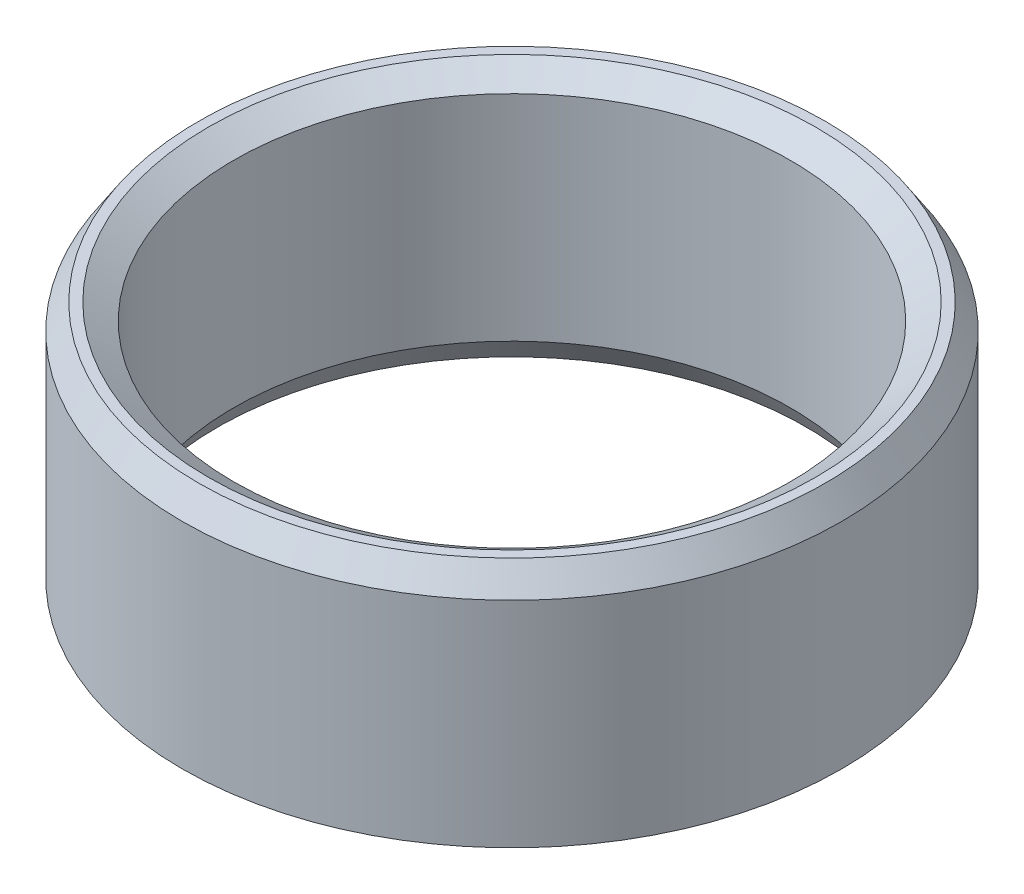
ISO-10303-21;
HEADER;
FILE_DESCRIPTION(('STEP AP214'),'2;1');
FILE_NAME('part.step','',(''),(''),'','','');
FILE_SCHEMA(('AUTOMOTIVE_DESIGN { 1 0 10303 214 1 1 1 1 }'));
ENDSEC;
DATA;
#1=APPLICATION_CONTEXT('core data for automotive mechanical design processes');
#2=APPLICATION_PROTOCOL_DEFINITION('international standard','automotive_design',2000,#1);
#3=PRODUCT_CONTEXT('',#1,'mechanical');
#4=PRODUCT('Part','Part','',(#3));
#5=PRODUCT_RELATED_PRODUCT_CATEGORY('part','',(#4));
#6=PRODUCT_DEFINITION_FORMATION('','',#4);
#7=PRODUCT_DEFINITION_CONTEXT('part definition',#1,'design');
#8=PRODUCT_DEFINITION('design','',#6,#7);
#9=PRODUCT_DEFINITION_SHAPE('','',#8);
#10=(LENGTH_UNIT() NAMED_UNIT(*) SI_UNIT(.MILLI.,.METRE.));
#11=(NAMED_UNIT(*) PLANE_ANGLE_UNIT() SI_UNIT($,.RADIAN.));
#12=(NAMED_UNIT(*) SI_UNIT($,.STERADIAN.) SOLID_ANGLE_UNIT());
#13=UNCERTAINTY_MEASURE_WITH_UNIT(LENGTH_MEASURE(1.E-05),#10,'distance_accuracy_value','');
#14=(GEOMETRIC_REPRESENTATION_CONTEXT(3) GLOBAL_UNCERTAINTY_ASSIGNED_CONTEXT((#13)) GLOBAL_UNIT_ASSIGNED_CONTEXT((#10,
#11,#12)) REPRESENTATION_CONTEXT('',''));
#15=CARTESIAN_POINT('',(0.,0.,0.));
#16=DIRECTION('',(0.,0.,1.));
#17=DIRECTION('',(1.,0.,0.));
#18=AXIS2_PLACEMENT_3D('',#15,#16,#17);
#19=CARTESIAN_POINT('',(0.,17.4501246890731,0.));
#20=DIRECTION('',(0.,-1.,0.));
#21=DIRECTION('',(0.,0.,-1.));
#22=AXIS2_PLACEMENT_3D('',#19,#20,#21);
#23=CYLINDRICAL_SURFACE('',#22,22.5);
#24=CARTESIAN_POINT('',(0.,1.11153424608768,0.));
#25=DIRECTION('',(0.,1.,0.));
#26=DIRECTION('',(0.,0.,1.));
#27=AXIS2_PLACEMENT_3D('',#24,#25,#26);
#28=CIRCLE('',#27,22.5);
#29=CARTESIAN_POINT('',(0.,1.11153424608768,22.5));
#30=VERTEX_POINT('',#29);
#31=EDGE_CURVE('E10',#30,#30,#28,.T.);
#32=ORIENTED_EDGE('',*,*,#31,.T.);
#33=EDGE_LOOP('',(#32));
#34=FACE_BOUND('',#33,.T.);
#35=CARTESIAN_POINT('',(0.,15.7388702572168,0.));
#36=DIRECTION('',(0.,1.,0.));
#37=DIRECTION('',(0.,0.,1.));
#38=AXIS2_PLACEMENT_3D('',#35,#36,#37);
#39=CIRCLE('',#38,22.5);
#40=CARTESIAN_POINT('',(0.,15.7388702572168,22.5));
#41=VERTEX_POINT('',#40);
#42=EDGE_CURVE('E50',#41,#41,#39,.F.);
#43=ORIENTED_EDGE('',*,*,#42,.T.);
#44=EDGE_LOOP('',(#43));
#45=FACE_BOUND('',#44,.T.);
#46=ADVANCED_FACE('F39',(#34,#45),#23,.T.);
#47=CARTESIAN_POINT('',(0.,17.4501246890731,0.));
#48=DIRECTION('',(0.,1.,0.));
#49=DIRECTION('',(0.,0.,1.));
#50=AXIS2_PLACEMENT_3D('',#47,#48,#49);
#51=PLANE('',#50);
#52=CARTESIAN_POINT('',(0.,17.4501246890731,0.));
#53=DIRECTION('',(0.,1.,0.));
#54=DIRECTION('',(0.,0.,1.));
#55=AXIS2_PLACEMENT_3D('',#52,#53,#54);
#56=CIRCLE('',#55,20.7116075863652);
#57=CARTESIAN_POINT('',(0.,17.4501246890731,20.7116075863652));
#58=VERTEX_POINT('',#57);
#59=EDGE_CURVE('E58',#58,#58,#56,.F.);
#60=ORIENTED_EDGE('',*,*,#59,.T.);
#61=EDGE_LOOP('',(#60));
#62=FACE_BOUND('',#61,.T.);
#63=CARTESIAN_POINT('',(0.,17.4501246890731,0.));
#64=DIRECTION('',(0.,1.,0.));
#65=DIRECTION('',(0.,0.,1.));
#66=AXIS2_PLACEMENT_3D('',#63,#64,#65);
#67=CIRCLE('',#66,21.3884657539123);
#68=CARTESIAN_POINT('',(0.,17.4501246890731,21.3884657539123));
#69=VERTEX_POINT('',#68);
#70=EDGE_CURVE('E61',#69,#69,#67,.T.);
#71=ORIENTED_EDGE('',*,*,#70,.T.);
#72=EDGE_LOOP('',(#71));
#73=FACE_BOUND('',#72,.T.);
#74=ADVANCED_FACE('F88',(#62,#73),#51,.T.);
#75=CARTESIAN_POINT('',(0.,0.,0.));
#76=DIRECTION('',(0.,1.,0.));
#77=DIRECTION('',(0.,0.,1.));
#78=AXIS2_PLACEMENT_3D('',#75,#76,#77);
#79=PLANE('',#78);
#80=CARTESIAN_POINT('',(0.,0.,0.));
#81=DIRECTION('',(0.,1.,0.));
#82=DIRECTION('',(0.,0.,1.));
#83=AXIS2_PLACEMENT_3D('',#80,#81,#82);
#84=CIRCLE('',#83,20.1118874005966);
#85=CARTESIAN_POINT('',(0.,0.,20.1118874005966));
#86=VERTEX_POINT('',#85);
#87=EDGE_CURVE('E51',#86,#86,#84,.T.);
#88=ORIENTED_EDGE('',*,*,#87,.T.);
#89=EDGE_LOOP('',(#88));
#90=FACE_BOUND('',#89,.T.);
#91=CARTESIAN_POINT('',(0.,0.,0.));
#92=DIRECTION('',(0.,1.,0.));
#93=DIRECTION('',(0.,0.,1.));
#94=AXIS2_PLACEMENT_3D('',#91,#92,#93);
#95=CIRCLE('',#94,20.7887455681437);
#96=CARTESIAN_POINT('',(0.,0.,20.7887455681437));
#97=VERTEX_POINT('',#96);
#98=EDGE_CURVE('E54',#97,#97,#95,.F.);
#99=ORIENTED_EDGE('',*,*,#98,.T.);
#100=EDGE_LOOP('',(#99));
#101=FACE_BOUND('',#100,.T.);
#102=ADVANCED_FACE('F83',(#90,#101),#79,.F.);
#103=CARTESIAN_POINT('',(0.,17.4501246890731,0.));
#104=DIRECTION('',(0.,-1.,0.));
#105=DIRECTION('',(0.,0.,-1.));
#106=AXIS2_PLACEMENT_3D('',#103,#104,#105);
#107=CYLINDRICAL_SURFACE('',#106,19.0003531545089);
#108=CARTESIAN_POINT('',(0.,16.3385904429854,0.));
#109=DIRECTION('',(0.,1.,0.));
#110=DIRECTION('',(0.,0.,1.));
#111=AXIS2_PLACEMENT_3D('',#108,#109,#110);
#112=CIRCLE('',#111,19.0003531545089);
#113=CARTESIAN_POINT('',(0.,16.3385904429854,19.0003531545089));
#114=VERTEX_POINT('',#113);
#115=EDGE_CURVE('E67',#114,#114,#112,.T.);
#116=ORIENTED_EDGE('',*,*,#115,.T.);
#117=EDGE_LOOP('',(#116));
#118=FACE_BOUND('',#117,.T.);
#119=CARTESIAN_POINT('',(0.,1.71125443185629,0.));
#120=DIRECTION('',(0.,1.,0.));
#121=DIRECTION('',(0.,0.,1.));
#122=AXIS2_PLACEMENT_3D('',#119,#120,#121);
#123=CIRCLE('',#122,19.0003531545089);
#124=CARTESIAN_POINT('',(0.,1.71125443185629,19.0003531545089));
#125=VERTEX_POINT('',#124);
#126=EDGE_CURVE('E69',#125,#125,#123,.F.);
#127=ORIENTED_EDGE('',*,*,#126,.T.);
#128=EDGE_LOOP('',(#127));
#129=FACE_BOUND('',#128,.T.);
#130=ADVANCED_FACE('F71',(#118,#129),#107,.F.);
#131=CARTESIAN_POINT('',(0.,16.3385904429854,0.));
#132=DIRECTION('',(0.,1.,0.));
#133=DIRECTION('',(0.,0.,1.));
#134=AXIS2_PLACEMENT_3D('',#131,#132,#133);
#135=CONICAL_SURFACE('',#134,19.0003531545089,0.99474206523775);
#136=ORIENTED_EDGE('',*,*,#59,.F.);
#137=EDGE_LOOP('',(#136));
#138=FACE_BOUND('',#137,.T.);
#139=ORIENTED_EDGE('',*,*,#115,.F.);
#140=EDGE_LOOP('',(#139));
#141=FACE_BOUND('',#140,.T.);
#142=ADVANCED_FACE('F77',(#138,#141),#135,.F.);
#143=CARTESIAN_POINT('',(0.,0.,0.));
#144=DIRECTION('',(0.,-1.,0.));
#145=DIRECTION('',(0.,0.,-1.));
#146=AXIS2_PLACEMENT_3D('',#143,#144,#145);
#147=CONICAL_SURFACE('',#146,20.1118874005966,0.576054261557146);
#148=ORIENTED_EDGE('',*,*,#126,.F.);
#149=EDGE_LOOP('',(#148));
#150=FACE_BOUND('',#149,.T.);
#151=ORIENTED_EDGE('',*,*,#87,.F.);
#152=EDGE_LOOP('',(#151));
#153=FACE_BOUND('',#152,.T.);
#154=ADVANCED_FACE('F73',(#150,#153),#147,.F.);
#155=CARTESIAN_POINT('',(0.,1.11153424608768,0.));
#156=DIRECTION('',(0.,1.,0.));
#157=DIRECTION('',(0.,0.,1.));
#158=AXIS2_PLACEMENT_3D('',#155,#156,#157);
#159=CONICAL_SURFACE('',#158,22.5,0.99474206523775);
#160=ORIENTED_EDGE('',*,*,#98,.F.);
#161=EDGE_LOOP('',(#160));
#162=FACE_BOUND('',#161,.T.);
#163=ORIENTED_EDGE('',*,*,#31,.F.);
#164=EDGE_LOOP('',(#163));
#165=FACE_BOUND('',#164,.T.);
#166=ADVANCED_FACE('F76',(#162,#165),#159,.T.);
#167=CARTESIAN_POINT('',(0.,17.4501246890731,0.));
#168=DIRECTION('',(0.,-1.,0.));
#169=DIRECTION('',(0.,0.,-1.));
#170=AXIS2_PLACEMENT_3D('',#167,#168,#169);
#171=CONICAL_SURFACE('',#170,21.3884657539123,0.576054261557145);
#172=ORIENTED_EDGE('',*,*,#42,.F.);
#173=EDGE_LOOP('',(#172));
#174=FACE_BOUND('',#173,.T.);
#175=ORIENTED_EDGE('',*,*,#70,.F.);
#176=EDGE_LOOP('',(#175));
#177=FACE_BOUND('',#176,.T.);
#178=ADVANCED_FACE('F45',(#174,#177),#171,.T.);
#179=CLOSED_SHELL('',(#46,#74,#102,#130,#142,#154,#166,#178));
#180=MANIFOLD_SOLID_BREP('B2',#179);
#181=ADVANCED_BREP_SHAPE_REPRESENTATION('',(#18,#180),#14);
#182=SHAPE_DEFINITION_REPRESENTATION(#9,#181);
ENDSEC;
END-ISO-10303-21;
